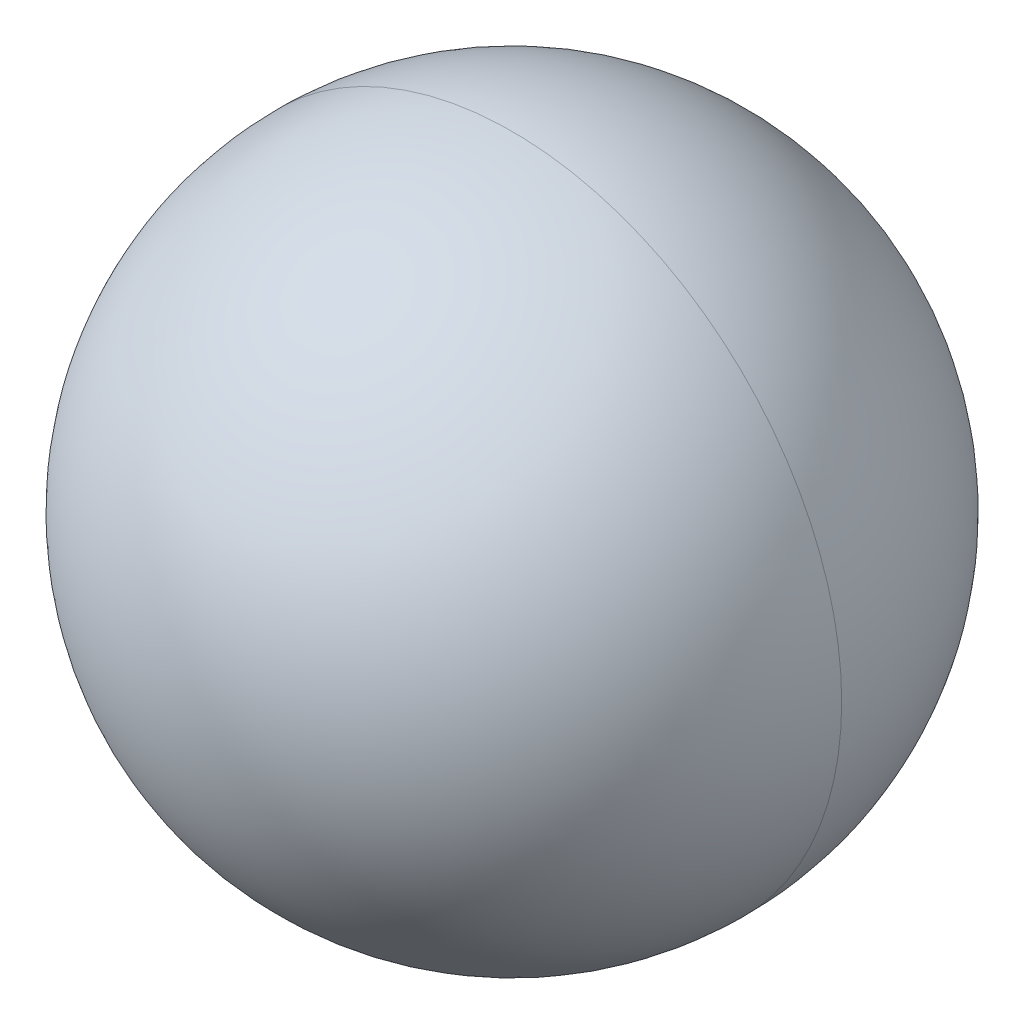
ISO-10303-21;
HEADER;
FILE_DESCRIPTION(('STEP AP214'),'2;1');
FILE_NAME('part.step','',(''),(''),'','','');
FILE_SCHEMA(('AUTOMOTIVE_DESIGN { 1 0 10303 214 1 1 1 1 }'));
ENDSEC;
DATA;
#1=APPLICATION_CONTEXT('core data for automotive mechanical design processes');
#2=APPLICATION_PROTOCOL_DEFINITION('international standard','automotive_design',2000,#1);
#3=PRODUCT_CONTEXT('',#1,'mechanical');
#4=PRODUCT('Part','Part','',(#3));
#5=PRODUCT_RELATED_PRODUCT_CATEGORY('part','',(#4));
#6=PRODUCT_DEFINITION_FORMATION('','',#4);
#7=PRODUCT_DEFINITION_CONTEXT('part definition',#1,'design');
#8=PRODUCT_DEFINITION('design','',#6,#7);
#9=PRODUCT_DEFINITION_SHAPE('','',#8);
#10=(LENGTH_UNIT() NAMED_UNIT(*) SI_UNIT(.MILLI.,.METRE.));
#11=(NAMED_UNIT(*) PLANE_ANGLE_UNIT() SI_UNIT($,.RADIAN.));
#12=(NAMED_UNIT(*) SI_UNIT($,.STERADIAN.) SOLID_ANGLE_UNIT());
#13=UNCERTAINTY_MEASURE_WITH_UNIT(LENGTH_MEASURE(1.E-05),#10,'distance_accuracy_value','');
#14=(GEOMETRIC_REPRESENTATION_CONTEXT(3) GLOBAL_UNCERTAINTY_ASSIGNED_CONTEXT((#13)) GLOBAL_UNIT_ASSIGNED_CONTEXT((#10,
#11,#12)) REPRESENTATION_CONTEXT('',''));
#15=CARTESIAN_POINT('',(0.,0.,0.));
#16=DIRECTION('',(0.,0.,1.));
#17=DIRECTION('',(1.,0.,0.));
#18=AXIS2_PLACEMENT_3D('',#15,#16,#17);
#19=CARTESIAN_POINT('',(1.5,5.15,0.));
#20=DIRECTION('',(1.,0.,0.));
#21=DIRECTION('',(0.,0.,-1.));
#22=AXIS2_PLACEMENT_3D('',#19,#20,#21);
#23=SPHERICAL_SURFACE('',#22,0.6);
#24=CARTESIAN_POINT('',(1.5,5.15,0.));
#25=DIRECTION('',(0.,0.,1.));
#26=DIRECTION('',(1.,0.,0.));
#27=AXIS2_PLACEMENT_3D('',#24,#25,#26);
#28=CIRCLE('',#27,0.6);
#29=CARTESIAN_POINT('',(2.1,5.15,0.));
#30=VERTEX_POINT('',#29);
#31=CARTESIAN_POINT('',(0.9,5.15,0.));
#32=VERTEX_POINT('',#31);
#33=EDGE_CURVE('E11',#30,#32,#28,.T.);
#34=ORIENTED_EDGE('',*,*,#33,.T.);
#35=CARTESIAN_POINT('',(1.5,5.15,0.));
#36=DIRECTION('',(0.,0.,-1.));
#37=DIRECTION('',(1.,0.,0.));
#38=AXIS2_PLACEMENT_3D('',#35,#36,#37);
#39=CIRCLE('',#38,0.6);
#40=EDGE_CURVE('E25',#30,#32,#39,.T.);
#41=ORIENTED_EDGE('',*,*,#40,.F.);
#42=EDGE_LOOP('',(#34,#41));
#43=FACE_BOUND('',#42,.T.);
#44=ADVANCED_FACE('F17',(#43),#23,.T.);
#45=CARTESIAN_POINT('',(1.5,5.15,0.));
#46=DIRECTION('',(1.,0.,0.));
#47=DIRECTION('',(0.,0.,1.));
#48=AXIS2_PLACEMENT_3D('',#45,#46,#47);
#49=SPHERICAL_SURFACE('',#48,0.6);
#50=ORIENTED_EDGE('',*,*,#33,.F.);
#51=ORIENTED_EDGE('',*,*,#40,.T.);
#52=EDGE_LOOP('',(#50,#51));
#53=FACE_BOUND('',#52,.T.);
#54=ADVANCED_FACE('F33',(#53),#49,.T.);
#55=CLOSED_SHELL('',(#44,#54));
#56=MANIFOLD_SOLID_BREP('B1',#55);
#57=ADVANCED_BREP_SHAPE_REPRESENTATION('',(#18,#56),#14);
#58=SHAPE_DEFINITION_REPRESENTATION(#9,#57);
ENDSEC;
END-ISO-10303-21;
